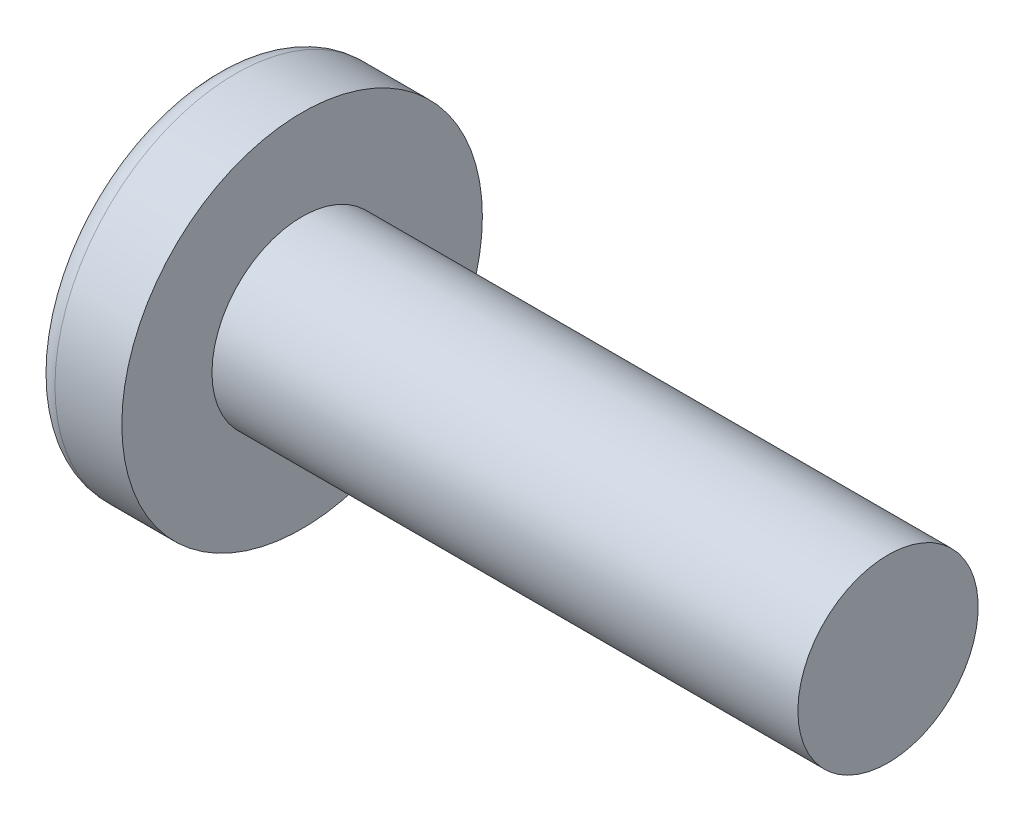
ISO-10303-21;
HEADER;
FILE_DESCRIPTION(('STEP AP214'),'2;1');
FILE_NAME('part.step','',(''),(''),'','','');
FILE_SCHEMA(('AUTOMOTIVE_DESIGN { 1 0 10303 214 1 1 1 1 }'));
ENDSEC;
DATA;
#1=APPLICATION_CONTEXT('core data for automotive mechanical design processes');
#2=APPLICATION_PROTOCOL_DEFINITION('international standard','automotive_design',2000,#1);
#3=PRODUCT_CONTEXT('',#1,'mechanical');
#4=PRODUCT('Part','Part','',(#3));
#5=PRODUCT_RELATED_PRODUCT_CATEGORY('part','',(#4));
#6=PRODUCT_DEFINITION_FORMATION('','',#4);
#7=PRODUCT_DEFINITION_CONTEXT('part definition',#1,'design');
#8=PRODUCT_DEFINITION('design','',#6,#7);
#9=PRODUCT_DEFINITION_SHAPE('','',#8);
#10=(LENGTH_UNIT() NAMED_UNIT(*) SI_UNIT(.MILLI.,.METRE.));
#11=(NAMED_UNIT(*) PLANE_ANGLE_UNIT() SI_UNIT($,.RADIAN.));
#12=(NAMED_UNIT(*) SI_UNIT($,.STERADIAN.) SOLID_ANGLE_UNIT());
#13=UNCERTAINTY_MEASURE_WITH_UNIT(LENGTH_MEASURE(1.E-05),#10,'distance_accuracy_value','');
#14=(GEOMETRIC_REPRESENTATION_CONTEXT(3) GLOBAL_UNCERTAINTY_ASSIGNED_CONTEXT((#13)) GLOBAL_UNIT_ASSIGNED_CONTEXT((#10,
#11,#12)) REPRESENTATION_CONTEXT('',''));
#15=CARTESIAN_POINT('',(0.,0.,0.));
#16=DIRECTION('',(0.,0.,1.));
#17=DIRECTION('',(1.,0.,0.));
#18=AXIS2_PLACEMENT_3D('',#15,#16,#17);
#19=CARTESIAN_POINT('',(6.5,0.,0.));
#20=DIRECTION('',(-1.,0.,0.));
#21=DIRECTION('',(0.,1.,0.));
#22=AXIS2_PLACEMENT_3D('',#19,#20,#21);
#23=SPHERICAL_SURFACE('',#22,6.5);
#24=CARTESIAN_POINT('',(1.22696010591455,0.,0.));
#25=DIRECTION('',(-1.,0.,0.));
#26=DIRECTION('',(0.,0.,1.));
#27=AXIS2_PLACEMENT_3D('',#24,#25,#26);
#28=CIRCLE('',#27,3.80066445182724);
#29=CARTESIAN_POINT('',(1.22696010591455,0.,3.80066445182724));
#30=VERTEX_POINT('',#29);
#31=EDGE_CURVE('E152',#30,#30,#28,.T.);
#32=ORIENTED_EDGE('',*,*,#31,.T.);
#33=EDGE_LOOP('',(#32));
#34=FACE_BOUND('',#33,.T.);
#35=CARTESIAN_POINT('',(6.48571960757402,-0.15048155459631,0.));
#36=DIRECTION('',(-0.0944735162161081,-0.995527375180494,0.));
#37=DIRECTION('',(0.995527375180494,-0.0944735162161081,0.));
#38=AXIS2_PLACEMENT_3D('',#35,#36,#37);
#39=CIRCLE('',#38,6.49824217555167);
#40=CARTESIAN_POINT('',(0.314004666074211,0.4352015980154,1.94783502836694));
#41=VERTEX_POINT('',#40);
#42=CARTESIAN_POINT('',(0.0329034112486436,0.461877533422321,0.461877533422323));
#43=VERTEX_POINT('',#42);
#44=EDGE_CURVE('E183',#41,#43,#39,.T.);
#45=ORIENTED_EDGE('',*,*,#44,.F.);
#46=CARTESIAN_POINT('',(5.02565375064329,0.,-1.83590765485334));
#47=DIRECTION('',(0.626149356629992,0.,0.779703137861998));
#48=DIRECTION('',(0.779703137861998,0.,-0.626149356629992));
#49=AXIS2_PLACEMENT_3D('',#46,#47,#48);
#50=CIRCLE('',#49,6.05852673674539);
#51=CARTESIAN_POINT('',(0.314004666074211,-0.435201598015413,1.94783502836693));
#52=VERTEX_POINT('',#51);
#53=EDGE_CURVE('E148',#41,#52,#50,.T.);
#54=ORIENTED_EDGE('',*,*,#53,.T.);
#55=CARTESIAN_POINT('',(6.48571960757402,0.15048155459631,0.));
#56=DIRECTION('',(-0.0944735162161081,0.995527375180494,0.));
#57=DIRECTION('',(-0.995527375180494,-0.0944735162161081,0.));
#58=AXIS2_PLACEMENT_3D('',#55,#56,#57);
#59=CIRCLE('',#58,6.49824217555167);
#60=CARTESIAN_POINT('',(0.0329034112486436,-0.461877533422324,0.461877533422323));
#61=VERTEX_POINT('',#60);
#62=EDGE_CURVE('E104',#61,#52,#59,.T.);
#63=ORIENTED_EDGE('',*,*,#62,.F.);
#64=CARTESIAN_POINT('',(6.48571960757402,0.,-0.15048155459631));
#65=DIRECTION('',(-0.0944735162161081,0.,-0.995527375180494));
#66=DIRECTION('',(-0.995527375180494,0.,0.0944735162161081));
#67=AXIS2_PLACEMENT_3D('',#64,#65,#66);
#68=CIRCLE('',#67,6.49824217555167);
#69=CARTESIAN_POINT('',(0.31400466607421,-1.94783502836693,0.435201598015406));
#70=VERTEX_POINT('',#69);
#71=EDGE_CURVE('E129',#70,#61,#68,.T.);
#72=ORIENTED_EDGE('',*,*,#71,.F.);
#73=CARTESIAN_POINT('',(5.02565375064329,1.83590765485334,0.));
#74=DIRECTION('',(0.626149356629992,-0.779703137861998,0.));
#75=DIRECTION('',(0.779703137861998,0.626149356629992,0.));
#76=AXIS2_PLACEMENT_3D('',#73,#74,#75);
#77=CIRCLE('',#76,6.05852673674539);
#78=CARTESIAN_POINT('',(0.31400466607421,-1.94783502836693,-0.435201598015407));
#79=VERTEX_POINT('',#78);
#80=EDGE_CURVE('E137',#70,#79,#77,.T.);
#81=ORIENTED_EDGE('',*,*,#80,.T.);
#82=CARTESIAN_POINT('',(6.48571960757402,0.,0.15048155459631));
#83=DIRECTION('',(-0.0944735162161081,0.,0.995527375180494));
#84=DIRECTION('',(0.995527375180494,0.,0.0944735162161081));
#85=AXIS2_PLACEMENT_3D('',#82,#83,#84);
#86=CIRCLE('',#85,6.49824217555167);
#87=CARTESIAN_POINT('',(0.0329034112486436,-0.461877533422321,-0.461877533422323));
#88=VERTEX_POINT('',#87);
#89=EDGE_CURVE('E47',#88,#79,#86,.T.);
#90=ORIENTED_EDGE('',*,*,#89,.F.);
#91=CARTESIAN_POINT('',(0.314004666074211,-0.435201598015399,-1.94783502836694));
#92=VERTEX_POINT('',#91);
#93=EDGE_CURVE('E190',#92,#88,#59,.T.);
#94=ORIENTED_EDGE('',*,*,#93,.F.);
#95=CARTESIAN_POINT('',(5.02565375064329,0.,1.83590765485334));
#96=DIRECTION('',(0.626149356629992,0.,-0.779703137861998));
#97=DIRECTION('',(-0.779703137861998,0.,-0.626149356629992));
#98=AXIS2_PLACEMENT_3D('',#95,#96,#97);
#99=CIRCLE('',#98,6.05852673674539);
#100=CARTESIAN_POINT('',(0.314004666074212,0.435201598015413,-1.94783502836693));
#101=VERTEX_POINT('',#100);
#102=EDGE_CURVE('E130',#92,#101,#99,.T.);
#103=ORIENTED_EDGE('',*,*,#102,.T.);
#104=CARTESIAN_POINT('',(0.0329034112486436,0.461877533422324,-0.461877533422323));
#105=VERTEX_POINT('',#104);
#106=EDGE_CURVE('E178',#105,#101,#39,.T.);
#107=ORIENTED_EDGE('',*,*,#106,.F.);
#108=CARTESIAN_POINT('',(0.314004666074212,1.94783502836693,-0.435201598015406));
#109=VERTEX_POINT('',#108);
#110=EDGE_CURVE('E40',#109,#105,#86,.T.);
#111=ORIENTED_EDGE('',*,*,#110,.F.);
#112=CARTESIAN_POINT('',(5.02565375064329,-1.83590765485334,0.));
#113=DIRECTION('',(0.626149356629992,0.779703137861998,0.));
#114=DIRECTION('',(-0.779703137861998,0.626149356629992,0.));
#115=AXIS2_PLACEMENT_3D('',#112,#113,#114);
#116=CIRCLE('',#115,6.05852673674539);
#117=CARTESIAN_POINT('',(0.314004666074212,1.94783502836693,0.435201598015407));
#118=VERTEX_POINT('',#117);
#119=EDGE_CURVE('E11',#109,#118,#116,.T.);
#120=ORIENTED_EDGE('',*,*,#119,.T.);
#121=EDGE_CURVE('E166',#43,#118,#68,.T.);
#122=ORIENTED_EDGE('',*,*,#121,.F.);
#123=EDGE_LOOP('',(#45,#54,#63,#72,#81,#90,#94,#103,#107,#111,#120,#122));
#124=FACE_BOUND('',#123,.T.);
#125=ADVANCED_FACE('F32',(#34,#124),#23,.T.);
#126=CARTESIAN_POINT('',(2.73951715374841,0.,-0.20502541296061));
#127=DIRECTION('',(-0.0944735162161081,0.,0.995527375180494));
#128=DIRECTION('',(0.995527375180494,0.,0.0944735162161081));
#129=AXIS2_PLACEMENT_3D('',#126,#127,#128);
#130=PLANE('',#129);
#131=ORIENTED_EDGE('',*,*,#110,.T.);
#132=DIRECTION('',(0.991114231601325,-0.0940547178968607,0.0940547178968604));
#133=VECTOR('',#132,1.);
#134=CARTESIAN_POINT('',(2.75862941145706,0.203211698708667,-0.203211698708667));
#135=LINE('',#134,#133);
#136=CARTESIAN_POINT('',(2.45,0.232500000000001,-0.232499999999999));
#137=VERTEX_POINT('',#136);
#138=EDGE_CURVE('E172',#105,#137,#135,.T.);
#139=ORIENTED_EDGE('',*,*,#138,.T.);
#140=DIRECTION('',(0.777577482844895,-0.624442325509115,0.0737905162291584));
#141=VECTOR('',#140,1.);
#142=CARTESIAN_POINT('',(0.,2.2,-0.465));
#143=LINE('',#142,#141);
#144=EDGE_CURVE('E153',#109,#137,#143,.T.);
#145=ORIENTED_EDGE('',*,*,#144,.F.);
#146=EDGE_LOOP('',(#131,#139,#145));
#147=FACE_BOUND('',#146,.T.);
#148=ADVANCED_FACE('F171',(#147),#130,.T.);
#149=DIRECTION('',(0.777577482844895,0.624442325509115,0.0737905162291584));
#150=VECTOR('',#149,1.);
#151=CARTESIAN_POINT('',(0.,-2.2,-0.465));
#152=LINE('',#151,#150);
#153=CARTESIAN_POINT('',(2.45,-0.2325,-0.2325));
#154=VERTEX_POINT('',#153);
#155=EDGE_CURVE('E138',#79,#154,#152,.T.);
#156=ORIENTED_EDGE('',*,*,#155,.T.);
#157=DIRECTION('',(-0.991114231601325,-0.09405471789686,-0.0940547178968604));
#158=VECTOR('',#157,1.);
#159=CARTESIAN_POINT('',(2.75862941145706,-0.203211698708666,-0.203211698708667));
#160=LINE('',#159,#158);
#161=EDGE_CURVE('E193',#154,#88,#160,.T.);
#162=ORIENTED_EDGE('',*,*,#161,.T.);
#163=ORIENTED_EDGE('',*,*,#89,.T.);
#164=EDGE_LOOP('',(#156,#162,#163));
#165=FACE_BOUND('',#164,.T.);
#166=ADVANCED_FACE('F208',(#165),#130,.T.);
#167=CARTESIAN_POINT('',(2.73951715374841,0.,0.20502541296061));
#168=DIRECTION('',(-0.0944735162161081,0.,-0.995527375180494));
#169=DIRECTION('',(-0.995527375180494,0.,0.0944735162161081));
#170=AXIS2_PLACEMENT_3D('',#167,#168,#169);
#171=PLANE('',#170);
#172=DIRECTION('',(0.777577482844895,-0.624442325509115,-0.0737905162291585));
#173=VECTOR('',#172,1.);
#174=CARTESIAN_POINT('',(0.,2.2,0.465));
#175=LINE('',#174,#173);
#176=CARTESIAN_POINT('',(2.45,0.2325,0.2325));
#177=VERTEX_POINT('',#176);
#178=EDGE_CURVE('E209',#118,#177,#175,.T.);
#179=ORIENTED_EDGE('',*,*,#178,.T.);
#180=DIRECTION('',(-0.991114231601325,0.0940547178968601,0.0940547178968604));
#181=VECTOR('',#180,1.);
#182=CARTESIAN_POINT('',(2.75862941145706,0.203211698708666,0.203211698708667));
#183=LINE('',#182,#181);
#184=EDGE_CURVE('E187',#177,#43,#183,.T.);
#185=ORIENTED_EDGE('',*,*,#184,.T.);
#186=ORIENTED_EDGE('',*,*,#121,.T.);
#187=EDGE_LOOP('',(#179,#185,#186));
#188=FACE_BOUND('',#187,.T.);
#189=ADVANCED_FACE('F213',(#188),#171,.T.);
#190=ORIENTED_EDGE('',*,*,#71,.T.);
#191=DIRECTION('',(0.991114231601325,0.0940547178968607,-0.0940547178968603));
#192=VECTOR('',#191,1.);
#193=CARTESIAN_POINT('',(2.75862941145706,-0.203211698708668,0.203211698708667));
#194=LINE('',#193,#192);
#195=CARTESIAN_POINT('',(2.45,-0.232500000000001,0.232499999999999));
#196=VERTEX_POINT('',#195);
#197=EDGE_CURVE('E102',#61,#196,#194,.T.);
#198=ORIENTED_EDGE('',*,*,#197,.T.);
#199=DIRECTION('',(0.777577482844895,0.624442325509115,-0.0737905162291583));
#200=VECTOR('',#199,1.);
#201=CARTESIAN_POINT('',(0.,-2.2,0.465));
#202=LINE('',#201,#200);
#203=EDGE_CURVE('E127',#70,#196,#202,.T.);
#204=ORIENTED_EDGE('',*,*,#203,.F.);
#205=EDGE_LOOP('',(#190,#198,#204));
#206=FACE_BOUND('',#205,.T.);
#207=ADVANCED_FACE('F126',(#206),#171,.T.);
#208=CARTESIAN_POINT('',(-25.4,0.,0.));
#209=DIRECTION('',(-1.,0.,0.));
#210=DIRECTION('',(0.,0.,1.));
#211=AXIS2_PLACEMENT_3D('',#208,#209,#210);
#212=CYLINDRICAL_SURFACE('',#211,2.);
#213=CARTESIAN_POINT('',(16.1,0.,0.));
#214=DIRECTION('',(-1.,0.,0.));
#215=DIRECTION('',(0.,0.,1.));
#216=AXIS2_PLACEMENT_3D('',#213,#214,#215);
#217=CIRCLE('',#216,2.);
#218=CARTESIAN_POINT('',(16.1,0.,2.));
#219=VERTEX_POINT('',#218);
#220=EDGE_CURVE('E149',#219,#219,#217,.T.);
#221=ORIENTED_EDGE('',*,*,#220,.T.);
#222=EDGE_LOOP('',(#221));
#223=FACE_BOUND('',#222,.T.);
#224=CARTESIAN_POINT('',(3.1,0.,0.));
#225=DIRECTION('',(-1.,0.,0.));
#226=DIRECTION('',(0.,0.,1.));
#227=AXIS2_PLACEMENT_3D('',#224,#225,#226);
#228=CIRCLE('',#227,2.);
#229=CARTESIAN_POINT('',(3.1,0.,2.));
#230=VERTEX_POINT('',#229);
#231=EDGE_CURVE('E162',#230,#230,#228,.T.);
#232=ORIENTED_EDGE('',*,*,#231,.F.);
#233=EDGE_LOOP('',(#232));
#234=FACE_BOUND('',#233,.T.);
#235=ADVANCED_FACE('F34',(#223,#234),#212,.T.);
#236=CARTESIAN_POINT('',(3.1,2.,0.));
#237=DIRECTION('',(-1.,0.,0.));
#238=DIRECTION('',(0.,0.,1.));
#239=AXIS2_PLACEMENT_3D('',#236,#237,#238);
#240=PLANE('',#239);
#241=CARTESIAN_POINT('',(3.1,0.,0.));
#242=DIRECTION('',(-1.,0.,0.));
#243=DIRECTION('',(0.,0.,1.));
#244=AXIS2_PLACEMENT_3D('',#241,#242,#243);
#245=CIRCLE('',#244,4.);
#246=CARTESIAN_POINT('',(3.1,0.,4.));
#247=VERTEX_POINT('',#246);
#248=EDGE_CURVE('E159',#247,#247,#245,.T.);
#249=ORIENTED_EDGE('',*,*,#248,.F.);
#250=EDGE_LOOP('',(#249));
#251=FACE_BOUND('',#250,.T.);
#252=ORIENTED_EDGE('',*,*,#231,.T.);
#253=EDGE_LOOP('',(#252));
#254=FACE_BOUND('',#253,.T.);
#255=ADVANCED_FACE('F241',(#251,#254),#240,.F.);
#256=CARTESIAN_POINT('',(-25.4,0.,0.));
#257=DIRECTION('',(-1.,0.,0.));
#258=DIRECTION('',(0.,0.,1.));
#259=AXIS2_PLACEMENT_3D('',#256,#257,#258);
#260=CYLINDRICAL_SURFACE('',#259,4.);
#261=ORIENTED_EDGE('',*,*,#248,.T.);
#262=EDGE_LOOP('',(#261));
#263=FACE_BOUND('',#262,.T.);
#264=CARTESIAN_POINT('',(1.61635382117009,0.,0.));
#265=DIRECTION('',(-1.,0.,0.));
#266=DIRECTION('',(0.,0.,1.));
#267=AXIS2_PLACEMENT_3D('',#264,#265,#266);
#268=CIRCLE('',#267,4.);
#269=CARTESIAN_POINT('',(1.61635382117009,0.,4.));
#270=VERTEX_POINT('',#269);
#271=EDGE_CURVE('E156',#270,#270,#268,.T.);
#272=ORIENTED_EDGE('',*,*,#271,.F.);
#273=EDGE_LOOP('',(#272));
#274=FACE_BOUND('',#273,.T.);
#275=ADVANCED_FACE('F238',(#263,#274),#260,.T.);
#276=CARTESIAN_POINT('',(1.61635382117009,0.,0.));
#277=DIRECTION('',(-1.,0.,0.));
#278=DIRECTION('',(0.,0.,1.));
#279=AXIS2_PLACEMENT_3D('',#276,#277,#278);
#280=TOROIDAL_SURFACE('',#279,3.52,0.48);
#281=ORIENTED_EDGE('',*,*,#271,.T.);
#282=EDGE_LOOP('',(#281));
#283=FACE_BOUND('',#282,.T.);
#284=ORIENTED_EDGE('',*,*,#31,.F.);
#285=EDGE_LOOP('',(#284));
#286=FACE_BOUND('',#285,.T.);
#287=ADVANCED_FACE('F235',(#283,#286),#280,.T.);
#288=CARTESIAN_POINT('',(16.1,2.,0.));
#289=DIRECTION('',(1.,0.,0.));
#290=DIRECTION('',(0.,0.,-1.));
#291=AXIS2_PLACEMENT_3D('',#288,#289,#290);
#292=PLANE('',#291);
#293=ORIENTED_EDGE('',*,*,#220,.F.);
#294=EDGE_LOOP('',(#293));
#295=FACE_BOUND('',#294,.T.);
#296=ADVANCED_FACE('F233',(#295),#292,.T.);
#297=CARTESIAN_POINT('',(2.45,0.2325,0.2325));
#298=DIRECTION('',(0.626149356629992,0.779703137861998,0.));
#299=DIRECTION('',(-0.779703137861998,0.626149356629992,0.));
#300=AXIS2_PLACEMENT_3D('',#297,#298,#299);
#301=PLANE('',#300);
#302=ORIENTED_EDGE('',*,*,#144,.T.);
#303=DIRECTION('',(0.,0.,-1.));
#304=VECTOR('',#303,1.);
#305=CARTESIAN_POINT('',(2.45,0.2325,0.2325));
#306=LINE('',#305,#304);
#307=EDGE_CURVE('E120',#177,#137,#306,.T.);
#308=ORIENTED_EDGE('',*,*,#307,.F.);
#309=ORIENTED_EDGE('',*,*,#178,.F.);
#310=ORIENTED_EDGE('',*,*,#119,.F.);
#311=EDGE_LOOP('',(#302,#308,#309,#310));
#312=FACE_BOUND('',#311,.T.);
#313=ADVANCED_FACE('F212',(#312),#301,.F.);
#314=CARTESIAN_POINT('',(2.45,-0.2325,-0.2325));
#315=DIRECTION('',(0.626149356629992,-0.779703137861998,0.));
#316=DIRECTION('',(0.779703137861998,0.626149356629992,0.));
#317=AXIS2_PLACEMENT_3D('',#314,#315,#316);
#318=PLANE('',#317);
#319=ORIENTED_EDGE('',*,*,#203,.T.);
#320=DIRECTION('',(0.,0.,1.));
#321=VECTOR('',#320,1.);
#322=CARTESIAN_POINT('',(2.45,-0.2325,-0.2325));
#323=LINE('',#322,#321);
#324=EDGE_CURVE('E119',#154,#196,#323,.T.);
#325=ORIENTED_EDGE('',*,*,#324,.F.);
#326=ORIENTED_EDGE('',*,*,#155,.F.);
#327=ORIENTED_EDGE('',*,*,#80,.F.);
#328=EDGE_LOOP('',(#319,#325,#326,#327));
#329=FACE_BOUND('',#328,.T.);
#330=ADVANCED_FACE('F134',(#329),#318,.F.);
#331=CARTESIAN_POINT('',(2.45,0.2325,-0.2325));
#332=DIRECTION('',(-1.,0.,0.));
#333=DIRECTION('',(0.,0.,1.));
#334=AXIS2_PLACEMENT_3D('',#331,#332,#333);
#335=PLANE('',#334);
#336=DIRECTION('',(0.,1.,0.));
#337=VECTOR('',#336,1.);
#338=CARTESIAN_POINT('',(2.45,-0.2325,-0.2325));
#339=LINE('',#338,#337);
#340=EDGE_CURVE('E142',#154,#137,#339,.T.);
#341=ORIENTED_EDGE('',*,*,#340,.F.);
#342=ORIENTED_EDGE('',*,*,#324,.T.);
#343=DIRECTION('',(0.,-1.,0.));
#344=VECTOR('',#343,1.);
#345=CARTESIAN_POINT('',(2.45,0.2325,0.2325));
#346=LINE('',#345,#344);
#347=EDGE_CURVE('E111',#177,#196,#346,.T.);
#348=ORIENTED_EDGE('',*,*,#347,.F.);
#349=ORIENTED_EDGE('',*,*,#307,.T.);
#350=EDGE_LOOP('',(#341,#342,#348,#349));
#351=FACE_BOUND('',#350,.T.);
#352=ADVANCED_FACE('F140',(#351),#335,.T.);
#353=CARTESIAN_POINT('',(2.45,0.232500000000001,-0.232499999999999));
#354=DIRECTION('',(0.626149356629992,0.,-0.779703137861998));
#355=DIRECTION('',(0.779703137861998,0.,0.626149356629992));
#356=AXIS2_PLACEMENT_3D('',#353,#354,#355);
#357=PLANE('',#356);
#358=DIRECTION('',(0.777577482844895,0.0737905162291561,0.624442325509115));
#359=VECTOR('',#358,1.);
#360=CARTESIAN_POINT('',(0.,-0.464999999999992,-2.2));
#361=LINE('',#360,#359);
#362=EDGE_CURVE('E198',#92,#154,#361,.T.);
#363=ORIENTED_EDGE('',*,*,#362,.T.);
#364=ORIENTED_EDGE('',*,*,#340,.T.);
#365=DIRECTION('',(0.777577482844895,-0.0737905162291606,0.624442325509114));
#366=VECTOR('',#365,1.);
#367=CARTESIAN_POINT('',(0.,0.465000000000008,-2.2));
#368=LINE('',#367,#366);
#369=EDGE_CURVE('E108',#101,#137,#368,.T.);
#370=ORIENTED_EDGE('',*,*,#369,.F.);
#371=ORIENTED_EDGE('',*,*,#102,.F.);
#372=EDGE_LOOP('',(#363,#364,#370,#371));
#373=FACE_BOUND('',#372,.T.);
#374=ADVANCED_FACE('F203',(#373),#357,.F.);
#375=CARTESIAN_POINT('',(2.73951715374841,-0.20502541296061,0.));
#376=DIRECTION('',(-0.0944735162161081,0.995527375180494,0.));
#377=DIRECTION('',(-0.995527375180494,-0.0944735162161081,0.));
#378=AXIS2_PLACEMENT_3D('',#375,#376,#377);
#379=PLANE('',#378);
#380=ORIENTED_EDGE('',*,*,#93,.T.);
#381=ORIENTED_EDGE('',*,*,#161,.F.);
#382=ORIENTED_EDGE('',*,*,#362,.F.);
#383=EDGE_LOOP('',(#380,#381,#382));
#384=FACE_BOUND('',#383,.T.);
#385=ADVANCED_FACE('F207',(#384),#379,.T.);
#386=CARTESIAN_POINT('',(2.73951715374841,0.20502541296061,0.));
#387=DIRECTION('',(-0.0944735162161081,-0.995527375180494,0.));
#388=DIRECTION('',(0.995527375180494,-0.0944735162161081,0.));
#389=AXIS2_PLACEMENT_3D('',#386,#387,#388);
#390=PLANE('',#389);
#391=ORIENTED_EDGE('',*,*,#106,.T.);
#392=ORIENTED_EDGE('',*,*,#369,.T.);
#393=ORIENTED_EDGE('',*,*,#138,.F.);
#394=EDGE_LOOP('',(#391,#392,#393));
#395=FACE_BOUND('',#394,.T.);
#396=ADVANCED_FACE('F201',(#395),#390,.T.);
#397=CARTESIAN_POINT('',(2.45,-0.232500000000001,0.232499999999999));
#398=DIRECTION('',(0.626149356629992,0.,0.779703137861998));
#399=DIRECTION('',(-0.779703137861998,0.,0.626149356629992));
#400=AXIS2_PLACEMENT_3D('',#397,#398,#399);
#401=PLANE('',#400);
#402=DIRECTION('',(0.777577482844895,-0.0737905162291562,-0.624442325509115));
#403=VECTOR('',#402,1.);
#404=CARTESIAN_POINT('',(0.,0.464999999999992,2.2));
#405=LINE('',#404,#403);
#406=EDGE_CURVE('E107',#41,#177,#405,.T.);
#407=ORIENTED_EDGE('',*,*,#406,.T.);
#408=ORIENTED_EDGE('',*,*,#347,.T.);
#409=DIRECTION('',(0.777577482844895,0.0737905162291606,-0.624442325509114));
#410=VECTOR('',#409,1.);
#411=CARTESIAN_POINT('',(0.,-0.465000000000008,2.2));
#412=LINE('',#411,#410);
#413=EDGE_CURVE('E98',#52,#196,#412,.T.);
#414=ORIENTED_EDGE('',*,*,#413,.F.);
#415=ORIENTED_EDGE('',*,*,#53,.F.);
#416=EDGE_LOOP('',(#407,#408,#414,#415));
#417=FACE_BOUND('',#416,.T.);
#418=ADVANCED_FACE('F112',(#417),#401,.F.);
#419=ORIENTED_EDGE('',*,*,#44,.T.);
#420=ORIENTED_EDGE('',*,*,#184,.F.);
#421=ORIENTED_EDGE('',*,*,#406,.F.);
#422=EDGE_LOOP('',(#419,#420,#421));
#423=FACE_BOUND('',#422,.T.);
#424=ADVANCED_FACE('F214',(#423),#390,.T.);
#425=ORIENTED_EDGE('',*,*,#62,.T.);
#426=ORIENTED_EDGE('',*,*,#413,.T.);
#427=ORIENTED_EDGE('',*,*,#197,.F.);
#428=EDGE_LOOP('',(#425,#426,#427));
#429=FACE_BOUND('',#428,.T.);
#430=ADVANCED_FACE('F100',(#429),#379,.T.);
#431=CLOSED_SHELL('',(#125,#148,#166,#189,#207,#235,#255,#275,#287,#296,#313,#330,#352,#374,
#385,#396,#418,#424,#430));
#432=MANIFOLD_SOLID_BREP('B2',#431);
#433=ADVANCED_BREP_SHAPE_REPRESENTATION('',(#18,#432),#14);
#434=SHAPE_DEFINITION_REPRESENTATION(#9,#433);
ENDSEC;
END-ISO-10303-21;
